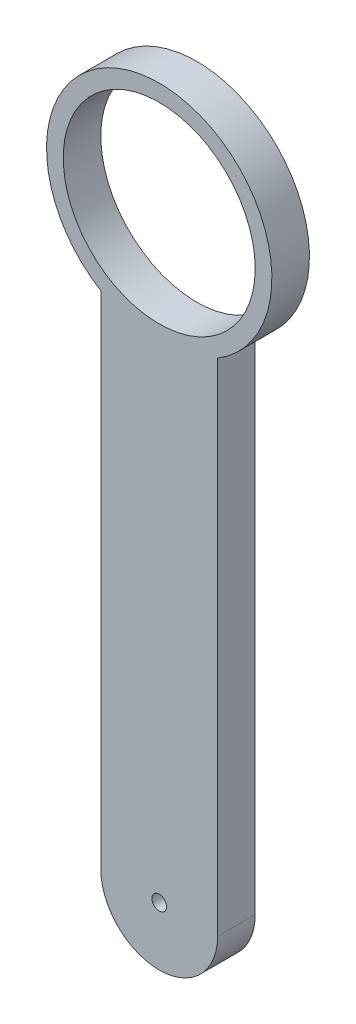
ISO-10303-21;
HEADER;
FILE_DESCRIPTION(('STEP AP214'),'2;1');
FILE_NAME('part.step','',(''),(''),'','','');
FILE_SCHEMA(('AUTOMOTIVE_DESIGN { 1 0 10303 214 1 1 1 1 }'));
ENDSEC;
DATA;
#1=APPLICATION_CONTEXT('core data for automotive mechanical design processes');
#2=APPLICATION_PROTOCOL_DEFINITION('international standard','automotive_design',2000,#1);
#3=PRODUCT_CONTEXT('',#1,'mechanical');
#4=PRODUCT('Part','Part','',(#3));
#5=PRODUCT_RELATED_PRODUCT_CATEGORY('part','',(#4));
#6=PRODUCT_DEFINITION_FORMATION('','',#4);
#7=PRODUCT_DEFINITION_CONTEXT('part definition',#1,'design');
#8=PRODUCT_DEFINITION('design','',#6,#7);
#9=PRODUCT_DEFINITION_SHAPE('','',#8);
#10=(LENGTH_UNIT() NAMED_UNIT(*) SI_UNIT(.MILLI.,.METRE.));
#11=(NAMED_UNIT(*) PLANE_ANGLE_UNIT() SI_UNIT($,.RADIAN.));
#12=(NAMED_UNIT(*) SI_UNIT($,.STERADIAN.) SOLID_ANGLE_UNIT());
#13=UNCERTAINTY_MEASURE_WITH_UNIT(LENGTH_MEASURE(1.E-05),#10,'distance_accuracy_value','');
#14=(GEOMETRIC_REPRESENTATION_CONTEXT(3) GLOBAL_UNCERTAINTY_ASSIGNED_CONTEXT((#13)) GLOBAL_UNIT_ASSIGNED_CONTEXT((#10,
#11,#12)) REPRESENTATION_CONTEXT('',''));
#15=CARTESIAN_POINT('',(0.,0.,0.));
#16=DIRECTION('',(0.,0.,1.));
#17=DIRECTION('',(1.,0.,0.));
#18=AXIS2_PLACEMENT_3D('',#15,#16,#17);
#19=CARTESIAN_POINT('',(14.,143.08679276123,9.));
#20=DIRECTION('',(0.,0.,1.));
#21=DIRECTION('',(1.,0.,0.));
#22=AXIS2_PLACEMENT_3D('',#19,#20,#21);
#23=PLANE('',#22);
#24=CARTESIAN_POINT('',(14.,0.,9.));
#25=DIRECTION('',(0.,0.,1.));
#26=DIRECTION('',(1.,0.,0.));
#27=AXIS2_PLACEMENT_3D('',#24,#25,#26);
#28=CIRCLE('',#27,1.75);
#29=CARTESIAN_POINT('',(15.75,0.,9.));
#30=VERTEX_POINT('',#29);
#31=EDGE_CURVE('E181',#30,#30,#28,.T.);
#32=ORIENTED_EDGE('',*,*,#31,.F.);
#33=EDGE_LOOP('',(#32));
#34=FACE_BOUND('',#33,.T.);
#35=DIRECTION('',(0.,1.,0.));
#36=VECTOR('',#35,1.);
#37=CARTESIAN_POINT('',(0.,0.,9.));
#38=LINE('',#37,#36);
#39=CARTESIAN_POINT('',(0.,0.,9.));
#40=VERTEX_POINT('',#39);
#41=CARTESIAN_POINT('',(0.,120.,9.));
#42=VERTEX_POINT('',#41);
#43=EDGE_CURVE('E119',#40,#42,#38,.T.);
#44=ORIENTED_EDGE('',*,*,#43,.F.);
#45=CARTESIAN_POINT('',(14.,0.,9.));
#46=DIRECTION('',(0.,0.,1.));
#47=DIRECTION('',(1.,0.,0.));
#48=AXIS2_PLACEMENT_3D('',#45,#46,#47);
#49=CIRCLE('',#48,14.);
#50=CARTESIAN_POINT('',(28.,0.,9.));
#51=VERTEX_POINT('',#50);
#52=EDGE_CURVE('E104',#40,#51,#49,.T.);
#53=ORIENTED_EDGE('',*,*,#52,.T.);
#54=DIRECTION('',(0.,1.,0.));
#55=VECTOR('',#54,1.);
#56=CARTESIAN_POINT('',(28.,0.,9.));
#57=LINE('',#56,#55);
#58=CARTESIAN_POINT('',(28.,120.,9.));
#59=VERTEX_POINT('',#58);
#60=EDGE_CURVE('E101',#51,#59,#57,.T.);
#61=ORIENTED_EDGE('',*,*,#60,.T.);
#62=CARTESIAN_POINT('',(14.,143.08679276123,9.));
#63=DIRECTION('',(0.,0.,1.));
#64=DIRECTION('',(1.,0.,0.));
#65=AXIS2_PLACEMENT_3D('',#62,#63,#64);
#66=CIRCLE('',#65,27.);
#67=EDGE_CURVE('E98',#59,#42,#66,.T.);
#68=ORIENTED_EDGE('',*,*,#67,.T.);
#69=EDGE_LOOP('',(#44,#53,#61,#68));
#70=FACE_BOUND('',#69,.T.);
#71=CARTESIAN_POINT('',(14.,143.08679276123,9.));
#72=DIRECTION('',(0.,0.,1.));
#73=DIRECTION('',(1.,0.,0.));
#74=AXIS2_PLACEMENT_3D('',#71,#72,#73);
#75=CIRCLE('',#74,23.);
#76=CARTESIAN_POINT('',(37.,143.08679276123,9.));
#77=VERTEX_POINT('',#76);
#78=EDGE_CURVE('E132',#77,#77,#75,.T.);
#79=ORIENTED_EDGE('',*,*,#78,.F.);
#80=EDGE_LOOP('',(#79));
#81=FACE_BOUND('',#80,.T.);
#82=ADVANCED_FACE('F54',(#34,#70,#81),#23,.T.);
#83=CARTESIAN_POINT('',(14.,143.08679276123,0.));
#84=DIRECTION('',(0.,0.,1.));
#85=DIRECTION('',(1.,0.,0.));
#86=AXIS2_PLACEMENT_3D('',#83,#84,#85);
#87=PLANE('',#86);
#88=CARTESIAN_POINT('',(14.,0.,0.));
#89=DIRECTION('',(0.,0.,-1.));
#90=DIRECTION('',(-1.,0.,0.));
#91=AXIS2_PLACEMENT_3D('',#88,#89,#90);
#92=CIRCLE('',#91,1.75);
#93=CARTESIAN_POINT('',(12.25,0.,0.));
#94=VERTEX_POINT('',#93);
#95=EDGE_CURVE('E186',#94,#94,#92,.T.);
#96=ORIENTED_EDGE('',*,*,#95,.F.);
#97=EDGE_LOOP('',(#96));
#98=FACE_BOUND('',#97,.T.);
#99=DIRECTION('',(0.,1.,0.));
#100=VECTOR('',#99,1.);
#101=CARTESIAN_POINT('',(0.,0.,0.));
#102=LINE('',#101,#100);
#103=CARTESIAN_POINT('',(0.,0.,0.));
#104=VERTEX_POINT('',#103);
#105=CARTESIAN_POINT('',(0.,120.,0.));
#106=VERTEX_POINT('',#105);
#107=EDGE_CURVE('E127',#104,#106,#102,.T.);
#108=ORIENTED_EDGE('',*,*,#107,.T.);
#109=CARTESIAN_POINT('',(14.,143.08679276123,0.));
#110=DIRECTION('',(0.,0.,1.));
#111=DIRECTION('',(1.,0.,0.));
#112=AXIS2_PLACEMENT_3D('',#109,#110,#111);
#113=CIRCLE('',#112,27.);
#114=CARTESIAN_POINT('',(28.,120.,0.));
#115=VERTEX_POINT('',#114);
#116=EDGE_CURVE('E131',#115,#106,#113,.T.);
#117=ORIENTED_EDGE('',*,*,#116,.F.);
#118=DIRECTION('',(0.,1.,0.));
#119=VECTOR('',#118,1.);
#120=CARTESIAN_POINT('',(28.,0.,0.));
#121=LINE('',#120,#119);
#122=CARTESIAN_POINT('',(28.,0.,0.));
#123=VERTEX_POINT('',#122);
#124=EDGE_CURVE('E112',#123,#115,#121,.T.);
#125=ORIENTED_EDGE('',*,*,#124,.F.);
#126=CARTESIAN_POINT('',(14.,0.,0.));
#127=DIRECTION('',(0.,0.,1.));
#128=DIRECTION('',(1.,0.,0.));
#129=AXIS2_PLACEMENT_3D('',#126,#127,#128);
#130=CIRCLE('',#129,14.);
#131=EDGE_CURVE('E89',#104,#123,#130,.T.);
#132=ORIENTED_EDGE('',*,*,#131,.F.);
#133=EDGE_LOOP('',(#108,#117,#125,#132));
#134=FACE_BOUND('',#133,.T.);
#135=CARTESIAN_POINT('',(14.,143.08679276123,0.));
#136=DIRECTION('',(0.,0.,1.));
#137=DIRECTION('',(1.,0.,0.));
#138=AXIS2_PLACEMENT_3D('',#135,#136,#137);
#139=CIRCLE('',#138,23.);
#140=CARTESIAN_POINT('',(37.,143.08679276123,0.));
#141=VERTEX_POINT('',#140);
#142=EDGE_CURVE('E179',#141,#141,#139,.T.);
#143=ORIENTED_EDGE('',*,*,#142,.T.);
#144=EDGE_LOOP('',(#143));
#145=FACE_BOUND('',#144,.T.);
#146=ADVANCED_FACE('F141',(#98,#134,#145),#87,.F.);
#147=CARTESIAN_POINT('',(0.,0.,9.));
#148=DIRECTION('',(-1.,0.,0.));
#149=DIRECTION('',(0.,0.,1.));
#150=AXIS2_PLACEMENT_3D('',#147,#148,#149);
#151=PLANE('',#150);
#152=ORIENTED_EDGE('',*,*,#107,.F.);
#153=DIRECTION('',(0.,0.,-1.));
#154=VECTOR('',#153,1.);
#155=CARTESIAN_POINT('',(0.,0.,9.));
#156=LINE('',#155,#154);
#157=EDGE_CURVE('E12',#40,#104,#156,.T.);
#158=ORIENTED_EDGE('',*,*,#157,.F.);
#159=ORIENTED_EDGE('',*,*,#43,.T.);
#160=DIRECTION('',(0.,0.,-1.));
#161=VECTOR('',#160,1.);
#162=CARTESIAN_POINT('',(0.,120.,9.));
#163=LINE('',#162,#161);
#164=EDGE_CURVE('E58',#42,#106,#163,.T.);
#165=ORIENTED_EDGE('',*,*,#164,.T.);
#166=EDGE_LOOP('',(#152,#158,#159,#165));
#167=FACE_BOUND('',#166,.T.);
#168=ADVANCED_FACE('F56',(#167),#151,.T.);
#169=CARTESIAN_POINT('',(14.,0.,9.));
#170=DIRECTION('',(0.,0.,-1.));
#171=DIRECTION('',(-1.,0.,0.));
#172=AXIS2_PLACEMENT_3D('',#169,#170,#171);
#173=CYLINDRICAL_SURFACE('',#172,14.);
#174=ORIENTED_EDGE('',*,*,#131,.T.);
#175=DIRECTION('',(0.,0.,-1.));
#176=VECTOR('',#175,1.);
#177=CARTESIAN_POINT('',(28.,0.,9.));
#178=LINE('',#177,#176);
#179=EDGE_CURVE('E65',#51,#123,#178,.T.);
#180=ORIENTED_EDGE('',*,*,#179,.F.);
#181=ORIENTED_EDGE('',*,*,#52,.F.);
#182=ORIENTED_EDGE('',*,*,#157,.T.);
#183=EDGE_LOOP('',(#174,#180,#181,#182));
#184=FACE_BOUND('',#183,.T.);
#185=ADVANCED_FACE('F145',(#184),#173,.T.);
#186=CARTESIAN_POINT('',(28.,0.,9.));
#187=DIRECTION('',(-1.,0.,0.));
#188=DIRECTION('',(0.,0.,1.));
#189=AXIS2_PLACEMENT_3D('',#186,#187,#188);
#190=PLANE('',#189);
#191=ORIENTED_EDGE('',*,*,#124,.T.);
#192=DIRECTION('',(0.,0.,-1.));
#193=VECTOR('',#192,1.);
#194=CARTESIAN_POINT('',(28.,120.,9.));
#195=LINE('',#194,#193);
#196=EDGE_CURVE('E109',#59,#115,#195,.T.);
#197=ORIENTED_EDGE('',*,*,#196,.F.);
#198=ORIENTED_EDGE('',*,*,#60,.F.);
#199=ORIENTED_EDGE('',*,*,#179,.T.);
#200=EDGE_LOOP('',(#191,#197,#198,#199));
#201=FACE_BOUND('',#200,.T.);
#202=ADVANCED_FACE('F110',(#201),#190,.F.);
#203=CARTESIAN_POINT('',(14.,143.08679276123,9.));
#204=DIRECTION('',(0.,0.,-1.));
#205=DIRECTION('',(-1.,0.,0.));
#206=AXIS2_PLACEMENT_3D('',#203,#204,#205);
#207=CYLINDRICAL_SURFACE('',#206,27.);
#208=ORIENTED_EDGE('',*,*,#116,.T.);
#209=ORIENTED_EDGE('',*,*,#164,.F.);
#210=ORIENTED_EDGE('',*,*,#67,.F.);
#211=ORIENTED_EDGE('',*,*,#196,.T.);
#212=EDGE_LOOP('',(#208,#209,#210,#211));
#213=FACE_BOUND('',#212,.T.);
#214=ADVANCED_FACE('F117',(#213),#207,.T.);
#215=CARTESIAN_POINT('',(14.,143.08679276123,9.));
#216=DIRECTION('',(0.,0.,-1.));
#217=DIRECTION('',(-1.,0.,0.));
#218=AXIS2_PLACEMENT_3D('',#215,#216,#217);
#219=CYLINDRICAL_SURFACE('',#218,23.);
#220=ORIENTED_EDGE('',*,*,#78,.T.);
#221=EDGE_LOOP('',(#220));
#222=FACE_BOUND('',#221,.T.);
#223=ORIENTED_EDGE('',*,*,#142,.F.);
#224=EDGE_LOOP('',(#223));
#225=FACE_BOUND('',#224,.T.);
#226=ADVANCED_FACE('F160',(#222,#225),#219,.F.);
#227=CARTESIAN_POINT('',(14.,0.,10.));
#228=DIRECTION('',(0.,0.,-1.));
#229=DIRECTION('',(-1.,0.,0.));
#230=AXIS2_PLACEMENT_3D('',#227,#228,#229);
#231=CYLINDRICAL_SURFACE('',#230,1.75);
#232=ORIENTED_EDGE('',*,*,#31,.T.);
#233=EDGE_LOOP('',(#232));
#234=FACE_BOUND('',#233,.T.);
#235=ORIENTED_EDGE('',*,*,#95,.T.);
#236=EDGE_LOOP('',(#235));
#237=FACE_BOUND('',#236,.T.);
#238=ADVANCED_FACE('F168',(#234,#237),#231,.F.);
#239=CLOSED_SHELL('',(#82,#146,#168,#185,#202,#214,#226,#238));
#240=MANIFOLD_SOLID_BREP('B2',#239);
#241=ADVANCED_BREP_SHAPE_REPRESENTATION('',(#18,#240),#14);
#242=SHAPE_DEFINITION_REPRESENTATION(#9,#241);
ENDSEC;
END-ISO-10303-21;
